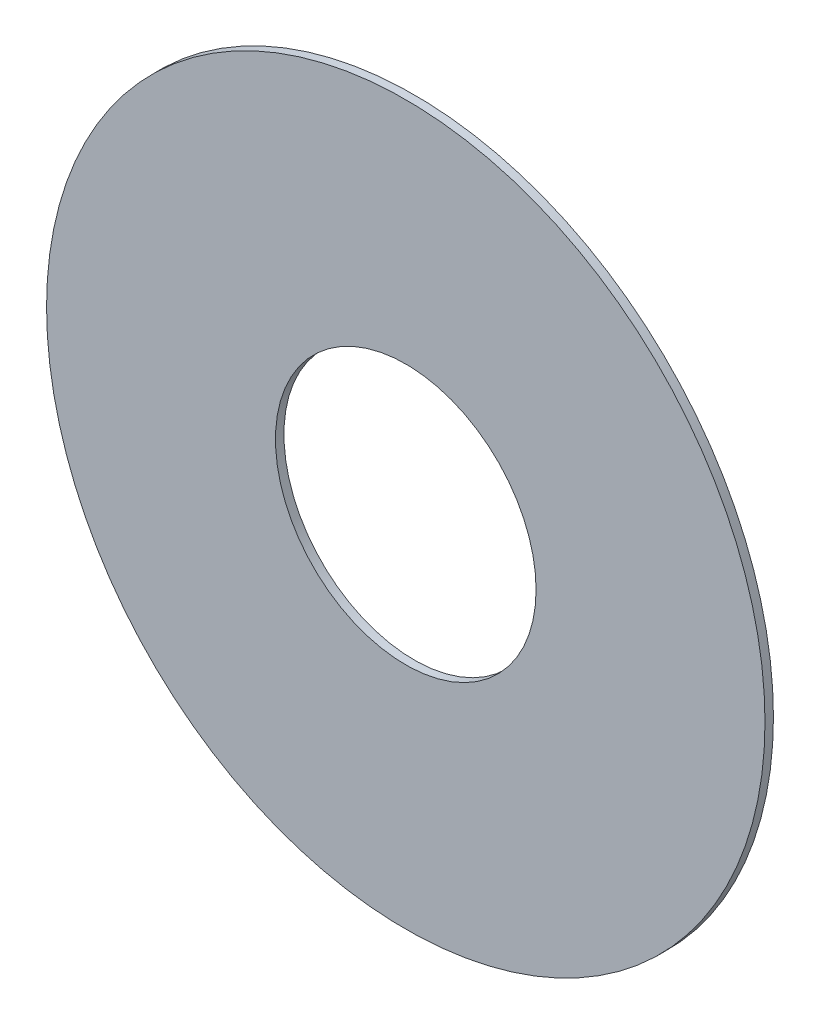
ISO-10303-21;
HEADER;
FILE_DESCRIPTION(('STEP AP214'),'2;1');
FILE_NAME('part.step','',(''),(''),'','','');
FILE_SCHEMA(('AUTOMOTIVE_DESIGN { 1 0 10303 214 1 1 1 1 }'));
ENDSEC;
DATA;
#1=APPLICATION_CONTEXT('core data for automotive mechanical design processes');
#2=APPLICATION_PROTOCOL_DEFINITION('international standard','automotive_design',2000,#1);
#3=PRODUCT_CONTEXT('',#1,'mechanical');
#4=PRODUCT('Part','Part','',(#3));
#5=PRODUCT_RELATED_PRODUCT_CATEGORY('part','',(#4));
#6=PRODUCT_DEFINITION_FORMATION('','',#4);
#7=PRODUCT_DEFINITION_CONTEXT('part definition',#1,'design');
#8=PRODUCT_DEFINITION('design','',#6,#7);
#9=PRODUCT_DEFINITION_SHAPE('','',#8);
#10=(LENGTH_UNIT() NAMED_UNIT(*) SI_UNIT(.MILLI.,.METRE.));
#11=(NAMED_UNIT(*) PLANE_ANGLE_UNIT() SI_UNIT($,.RADIAN.));
#12=(NAMED_UNIT(*) SI_UNIT($,.STERADIAN.) SOLID_ANGLE_UNIT());
#13=UNCERTAINTY_MEASURE_WITH_UNIT(LENGTH_MEASURE(1.E-05),#10,'distance_accuracy_value','');
#14=(GEOMETRIC_REPRESENTATION_CONTEXT(3) GLOBAL_UNCERTAINTY_ASSIGNED_CONTEXT((#13)) GLOBAL_UNIT_ASSIGNED_CONTEXT((#10,
#11,#12)) REPRESENTATION_CONTEXT('',''));
#15=CARTESIAN_POINT('',(0.,0.,0.));
#16=DIRECTION('',(0.,0.,1.));
#17=DIRECTION('',(1.,0.,0.));
#18=AXIS2_PLACEMENT_3D('',#15,#16,#17);
#19=CARTESIAN_POINT('',(0.,0.,0.6));
#20=DIRECTION('',(0.,0.,1.));
#21=DIRECTION('',(1.,0.,0.));
#22=AXIS2_PLACEMENT_3D('',#19,#20,#21);
#23=PLANE('',#22);
#24=CARTESIAN_POINT('',(0.,0.,0.6));
#25=DIRECTION('',(0.,0.,1.));
#26=DIRECTION('',(1.,0.,0.));
#27=AXIS2_PLACEMENT_3D('',#24,#25,#26);
#28=CIRCLE('',#27,25.5);
#29=CARTESIAN_POINT('',(25.5,0.,0.6));
#30=VERTEX_POINT('',#29);
#31=EDGE_CURVE('E10',#30,#30,#28,.T.);
#32=ORIENTED_EDGE('',*,*,#31,.T.);
#33=EDGE_LOOP('',(#32));
#34=FACE_BOUND('',#33,.T.);
#35=CARTESIAN_POINT('',(0.,0.,0.6));
#36=DIRECTION('',(0.,0.,1.));
#37=DIRECTION('',(1.,0.,0.));
#38=AXIS2_PLACEMENT_3D('',#35,#36,#37);
#39=CIRCLE('',#38,9.25);
#40=CARTESIAN_POINT('',(9.25,0.,0.6));
#41=VERTEX_POINT('',#40);
#42=EDGE_CURVE('E43',#41,#41,#39,.T.);
#43=ORIENTED_EDGE('',*,*,#42,.F.);
#44=EDGE_LOOP('',(#43));
#45=FACE_BOUND('',#44,.T.);
#46=ADVANCED_FACE('F32',(#34,#45),#23,.T.);
#47=CARTESIAN_POINT('',(0.,0.,0.));
#48=DIRECTION('',(0.,0.,1.));
#49=DIRECTION('',(1.,0.,0.));
#50=AXIS2_PLACEMENT_3D('',#47,#48,#49);
#51=PLANE('',#50);
#52=CARTESIAN_POINT('',(0.,0.,0.));
#53=DIRECTION('',(0.,0.,1.));
#54=DIRECTION('',(1.,0.,0.));
#55=AXIS2_PLACEMENT_3D('',#52,#53,#54);
#56=CIRCLE('',#55,25.5);
#57=CARTESIAN_POINT('',(25.5,0.,0.));
#58=VERTEX_POINT('',#57);
#59=EDGE_CURVE('E36',#58,#58,#56,.T.);
#60=ORIENTED_EDGE('',*,*,#59,.F.);
#61=EDGE_LOOP('',(#60));
#62=FACE_BOUND('',#61,.T.);
#63=CARTESIAN_POINT('',(0.,0.,0.));
#64=DIRECTION('',(0.,0.,1.));
#65=DIRECTION('',(1.,0.,0.));
#66=AXIS2_PLACEMENT_3D('',#63,#64,#65);
#67=CIRCLE('',#66,9.25);
#68=CARTESIAN_POINT('',(9.25,0.,0.));
#69=VERTEX_POINT('',#68);
#70=EDGE_CURVE('E45',#69,#69,#67,.T.);
#71=ORIENTED_EDGE('',*,*,#70,.T.);
#72=EDGE_LOOP('',(#71));
#73=FACE_BOUND('',#72,.T.);
#74=ADVANCED_FACE('F55',(#62,#73),#51,.F.);
#75=CARTESIAN_POINT('',(0.,0.,0.6));
#76=DIRECTION('',(0.,0.,-1.));
#77=DIRECTION('',(-1.,0.,0.));
#78=AXIS2_PLACEMENT_3D('',#75,#76,#77);
#79=CYLINDRICAL_SURFACE('',#78,25.5);
#80=ORIENTED_EDGE('',*,*,#31,.F.);
#81=EDGE_LOOP('',(#80));
#82=FACE_BOUND('',#81,.T.);
#83=ORIENTED_EDGE('',*,*,#59,.T.);
#84=EDGE_LOOP('',(#83));
#85=FACE_BOUND('',#84,.T.);
#86=ADVANCED_FACE('F34',(#82,#85),#79,.T.);
#87=CARTESIAN_POINT('',(0.,0.,0.6));
#88=DIRECTION('',(0.,0.,-1.));
#89=DIRECTION('',(-1.,0.,0.));
#90=AXIS2_PLACEMENT_3D('',#87,#88,#89);
#91=CYLINDRICAL_SURFACE('',#90,9.25);
#92=ORIENTED_EDGE('',*,*,#42,.T.);
#93=EDGE_LOOP('',(#92));
#94=FACE_BOUND('',#93,.T.);
#95=ORIENTED_EDGE('',*,*,#70,.F.);
#96=EDGE_LOOP('',(#95));
#97=FACE_BOUND('',#96,.T.);
#98=ADVANCED_FACE('F51',(#94,#97),#91,.F.);
#99=CLOSED_SHELL('',(#46,#74,#86,#98));
#100=MANIFOLD_SOLID_BREP('B2',#99);
#101=ADVANCED_BREP_SHAPE_REPRESENTATION('',(#18,#100),#14);
#102=SHAPE_DEFINITION_REPRESENTATION(#9,#101);
ENDSEC;
END-ISO-10303-21;
